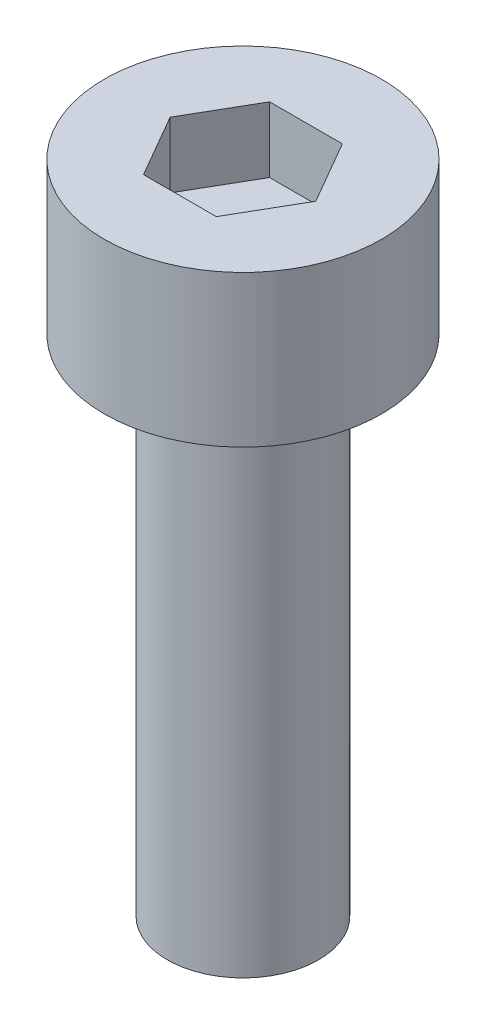
ISO-10303-21;
HEADER;
FILE_DESCRIPTION(('STEP AP214'),'2;1');
FILE_NAME('part.step','',(''),(''),'','','');
FILE_SCHEMA(('AUTOMOTIVE_DESIGN { 1 0 10303 214 1 1 1 1 }'));
ENDSEC;
DATA;
#1=APPLICATION_CONTEXT('core data for automotive mechanical design processes');
#2=APPLICATION_PROTOCOL_DEFINITION('international standard','automotive_design',2000,#1);
#3=PRODUCT_CONTEXT('',#1,'mechanical');
#4=PRODUCT('Part','Part','',(#3));
#5=PRODUCT_RELATED_PRODUCT_CATEGORY('part','',(#4));
#6=PRODUCT_DEFINITION_FORMATION('','',#4);
#7=PRODUCT_DEFINITION_CONTEXT('part definition',#1,'design');
#8=PRODUCT_DEFINITION('design','',#6,#7);
#9=PRODUCT_DEFINITION_SHAPE('','',#8);
#10=(LENGTH_UNIT() NAMED_UNIT(*) SI_UNIT(.MILLI.,.METRE.));
#11=(NAMED_UNIT(*) PLANE_ANGLE_UNIT() SI_UNIT($,.RADIAN.));
#12=(NAMED_UNIT(*) SI_UNIT($,.STERADIAN.) SOLID_ANGLE_UNIT());
#13=UNCERTAINTY_MEASURE_WITH_UNIT(LENGTH_MEASURE(1.E-05),#10,'distance_accuracy_value','');
#14=(GEOMETRIC_REPRESENTATION_CONTEXT(3) GLOBAL_UNCERTAINTY_ASSIGNED_CONTEXT((#13)) GLOBAL_UNIT_ASSIGNED_CONTEXT((#10,
#11,#12)) REPRESENTATION_CONTEXT('',''));
#15=CARTESIAN_POINT('',(0.,0.,0.));
#16=DIRECTION('',(0.,0.,1.));
#17=DIRECTION('',(1.,0.,0.));
#18=AXIS2_PLACEMENT_3D('',#15,#16,#17);
#19=CARTESIAN_POINT('',(0.,3.,0.));
#20=DIRECTION('',(0.,-1.,0.));
#21=DIRECTION('',(0.,0.,-1.));
#22=AXIS2_PLACEMENT_3D('',#19,#20,#21);
#23=CYLINDRICAL_SURFACE('',#22,2.75);
#24=CARTESIAN_POINT('',(0.,3.,0.));
#25=DIRECTION('',(0.,1.,0.));
#26=DIRECTION('',(0.,0.,1.));
#27=AXIS2_PLACEMENT_3D('',#24,#25,#26);
#28=CIRCLE('',#27,2.75);
#29=CARTESIAN_POINT('',(0.,3.,2.75));
#30=VERTEX_POINT('',#29);
#31=EDGE_CURVE('E45',#30,#30,#28,.T.);
#32=ORIENTED_EDGE('',*,*,#31,.F.);
#33=EDGE_LOOP('',(#32));
#34=FACE_BOUND('',#33,.T.);
#35=CARTESIAN_POINT('',(0.,0.,0.));
#36=DIRECTION('',(0.,1.,0.));
#37=DIRECTION('',(0.,0.,1.));
#38=AXIS2_PLACEMENT_3D('',#35,#36,#37);
#39=CIRCLE('',#38,2.75);
#40=CARTESIAN_POINT('',(0.,0.,2.75));
#41=VERTEX_POINT('',#40);
#42=EDGE_CURVE('E40',#41,#41,#39,.T.);
#43=ORIENTED_EDGE('',*,*,#42,.T.);
#44=EDGE_LOOP('',(#43));
#45=FACE_BOUND('',#44,.T.);
#46=ADVANCED_FACE('F37',(#34,#45),#23,.T.);
#47=CARTESIAN_POINT('',(0.,3.,0.));
#48=DIRECTION('',(0.,1.,0.));
#49=DIRECTION('',(0.,0.,1.));
#50=AXIS2_PLACEMENT_3D('',#47,#48,#49);
#51=PLANE('',#50);
#52=DIRECTION('',(0.5,0.,-0.866025403784439));
#53=VECTOR('',#52,1.);
#54=CARTESIAN_POINT('',(0.721687836487032,3.,1.25));
#55=LINE('',#54,#53);
#56=CARTESIAN_POINT('',(0.721687836487032,3.,1.25));
#57=VERTEX_POINT('',#56);
#58=CARTESIAN_POINT('',(1.44337567297406,3.,0.));
#59=VERTEX_POINT('',#58);
#60=EDGE_CURVE('E53',#57,#59,#55,.T.);
#61=ORIENTED_EDGE('',*,*,#60,.F.);
#62=DIRECTION('',(1.,0.,0.));
#63=VECTOR('',#62,1.);
#64=CARTESIAN_POINT('',(-0.721687836487033,3.,1.25));
#65=LINE('',#64,#63);
#66=CARTESIAN_POINT('',(-0.721687836487033,3.,1.25));
#67=VERTEX_POINT('',#66);
#68=EDGE_CURVE('E137',#67,#57,#65,.T.);
#69=ORIENTED_EDGE('',*,*,#68,.F.);
#70=DIRECTION('',(0.5,0.,0.866025403784439));
#71=VECTOR('',#70,1.);
#72=CARTESIAN_POINT('',(-1.44337567297407,3.,0.));
#73=LINE('',#72,#71);
#74=CARTESIAN_POINT('',(-1.44337567297407,3.,0.));
#75=VERTEX_POINT('',#74);
#76=EDGE_CURVE('E135',#75,#67,#73,.T.);
#77=ORIENTED_EDGE('',*,*,#76,.F.);
#78=DIRECTION('',(-0.5,0.,0.866025403784438));
#79=VECTOR('',#78,1.);
#80=CARTESIAN_POINT('',(-0.721687836487033,3.,-1.25));
#81=LINE('',#80,#79);
#82=CARTESIAN_POINT('',(-0.721687836487033,3.,-1.25));
#83=VERTEX_POINT('',#82);
#84=EDGE_CURVE('E101',#83,#75,#81,.T.);
#85=ORIENTED_EDGE('',*,*,#84,.F.);
#86=DIRECTION('',(-1.,0.,0.));
#87=VECTOR('',#86,1.);
#88=CARTESIAN_POINT('',(0.721687836487032,3.,-1.25));
#89=LINE('',#88,#87);
#90=CARTESIAN_POINT('',(0.721687836487032,3.,-1.25));
#91=VERTEX_POINT('',#90);
#92=EDGE_CURVE('E131',#91,#83,#89,.T.);
#93=ORIENTED_EDGE('',*,*,#92,.F.);
#94=DIRECTION('',(-0.5,0.,-0.866025403784439));
#95=VECTOR('',#94,1.);
#96=CARTESIAN_POINT('',(1.44337567297406,3.,0.));
#97=LINE('',#96,#95);
#98=EDGE_CURVE('E127',#59,#91,#97,.T.);
#99=ORIENTED_EDGE('',*,*,#98,.F.);
#100=EDGE_LOOP('',(#61,#69,#77,#85,#93,#99));
#101=FACE_BOUND('',#100,.T.);
#102=ORIENTED_EDGE('',*,*,#31,.T.);
#103=EDGE_LOOP('',(#102));
#104=FACE_BOUND('',#103,.T.);
#105=ADVANCED_FACE('F155',(#101,#104),#51,.T.);
#106=CARTESIAN_POINT('',(0.,0.,0.));
#107=DIRECTION('',(0.,1.,0.));
#108=DIRECTION('',(0.,0.,1.));
#109=AXIS2_PLACEMENT_3D('',#106,#107,#108);
#110=PLANE('',#109);
#111=CARTESIAN_POINT('',(0.,0.,0.));
#112=DIRECTION('',(0.,-1.,0.));
#113=DIRECTION('',(0.,0.,-1.));
#114=AXIS2_PLACEMENT_3D('',#111,#112,#113);
#115=CIRCLE('',#114,1.5);
#116=CARTESIAN_POINT('',(0.,0.,-1.5));
#117=VERTEX_POINT('',#116);
#118=EDGE_CURVE('E11',#117,#117,#115,.T.);
#119=ORIENTED_EDGE('',*,*,#118,.F.);
#120=EDGE_LOOP('',(#119));
#121=FACE_BOUND('',#120,.T.);
#122=ORIENTED_EDGE('',*,*,#42,.F.);
#123=EDGE_LOOP('',(#122));
#124=FACE_BOUND('',#123,.T.);
#125=ADVANCED_FACE('F152',(#121,#124),#110,.F.);
#126=CARTESIAN_POINT('',(0.721687836487032,1.7,1.25));
#127=DIRECTION('',(0.866025403784439,0.,0.5));
#128=DIRECTION('',(0.5,0.,-0.866025403784439));
#129=AXIS2_PLACEMENT_3D('',#126,#127,#128);
#130=PLANE('',#129);
#131=ORIENTED_EDGE('',*,*,#60,.T.);
#132=DIRECTION('',(0.,1.,0.));
#133=VECTOR('',#132,1.);
#134=CARTESIAN_POINT('',(1.44337567297406,1.7,0.));
#135=LINE('',#134,#133);
#136=CARTESIAN_POINT('',(1.44337567297406,1.7,0.));
#137=VERTEX_POINT('',#136);
#138=EDGE_CURVE('E83',#137,#59,#135,.T.);
#139=ORIENTED_EDGE('',*,*,#138,.F.);
#140=DIRECTION('',(0.5,0.,-0.866025403784439));
#141=VECTOR('',#140,1.);
#142=CARTESIAN_POINT('',(0.721687836487032,1.7,1.25));
#143=LINE('',#142,#141);
#144=CARTESIAN_POINT('',(0.721687836487032,1.7,1.25));
#145=VERTEX_POINT('',#144);
#146=EDGE_CURVE('E139',#145,#137,#143,.T.);
#147=ORIENTED_EDGE('',*,*,#146,.F.);
#148=DIRECTION('',(0.,1.,0.));
#149=VECTOR('',#148,1.);
#150=CARTESIAN_POINT('',(0.721687836487032,1.7,1.25));
#151=LINE('',#150,#149);
#152=EDGE_CURVE('E61',#145,#57,#151,.T.);
#153=ORIENTED_EDGE('',*,*,#152,.T.);
#154=EDGE_LOOP('',(#131,#139,#147,#153));
#155=FACE_BOUND('',#154,.T.);
#156=ADVANCED_FACE('F154',(#155),#130,.F.);
#157=CARTESIAN_POINT('',(-0.721687836487033,1.7,1.25));
#158=DIRECTION('',(0.,0.,1.));
#159=DIRECTION('',(1.,0.,0.));
#160=AXIS2_PLACEMENT_3D('',#157,#158,#159);
#161=PLANE('',#160);
#162=ORIENTED_EDGE('',*,*,#68,.T.);
#163=ORIENTED_EDGE('',*,*,#152,.F.);
#164=DIRECTION('',(1.,0.,0.));
#165=VECTOR('',#164,1.);
#166=CARTESIAN_POINT('',(-0.721687836487033,1.7,1.25));
#167=LINE('',#166,#165);
#168=CARTESIAN_POINT('',(-0.721687836487033,1.7,1.25));
#169=VERTEX_POINT('',#168);
#170=EDGE_CURVE('E113',#169,#145,#167,.T.);
#171=ORIENTED_EDGE('',*,*,#170,.F.);
#172=DIRECTION('',(0.,1.,0.));
#173=VECTOR('',#172,1.);
#174=CARTESIAN_POINT('',(-0.721687836487033,1.7,1.25));
#175=LINE('',#174,#173);
#176=EDGE_CURVE('E105',#169,#67,#175,.T.);
#177=ORIENTED_EDGE('',*,*,#176,.T.);
#178=EDGE_LOOP('',(#162,#163,#171,#177));
#179=FACE_BOUND('',#178,.T.);
#180=ADVANCED_FACE('F161',(#179),#161,.F.);
#181=CARTESIAN_POINT('',(-1.44337567297407,1.7,0.));
#182=DIRECTION('',(-0.866025403784439,0.,0.5));
#183=DIRECTION('',(0.5,0.,0.866025403784439));
#184=AXIS2_PLACEMENT_3D('',#181,#182,#183);
#185=PLANE('',#184);
#186=ORIENTED_EDGE('',*,*,#76,.T.);
#187=ORIENTED_EDGE('',*,*,#176,.F.);
#188=DIRECTION('',(0.5,0.,0.866025403784439));
#189=VECTOR('',#188,1.);
#190=CARTESIAN_POINT('',(-1.44337567297407,1.7,0.));
#191=LINE('',#190,#189);
#192=CARTESIAN_POINT('',(-1.44337567297407,1.7,0.));
#193=VERTEX_POINT('',#192);
#194=EDGE_CURVE('E109',#193,#169,#191,.T.);
#195=ORIENTED_EDGE('',*,*,#194,.F.);
#196=DIRECTION('',(0.,1.,0.));
#197=VECTOR('',#196,1.);
#198=CARTESIAN_POINT('',(-1.44337567297407,1.7,0.));
#199=LINE('',#198,#197);
#200=EDGE_CURVE('E94',#193,#75,#199,.T.);
#201=ORIENTED_EDGE('',*,*,#200,.T.);
#202=EDGE_LOOP('',(#186,#187,#195,#201));
#203=FACE_BOUND('',#202,.T.);
#204=ADVANCED_FACE('F110',(#203),#185,.F.);
#205=CARTESIAN_POINT('',(-0.721687836487033,1.7,-1.25));
#206=DIRECTION('',(-0.866025403784439,0.,-0.5));
#207=DIRECTION('',(-0.5,0.,0.866025403784439));
#208=AXIS2_PLACEMENT_3D('',#205,#206,#207);
#209=PLANE('',#208);
#210=ORIENTED_EDGE('',*,*,#84,.T.);
#211=ORIENTED_EDGE('',*,*,#200,.F.);
#212=DIRECTION('',(-0.5,0.,0.866025403784438));
#213=VECTOR('',#212,1.);
#214=CARTESIAN_POINT('',(-0.721687836487033,1.7,-1.25));
#215=LINE('',#214,#213);
#216=CARTESIAN_POINT('',(-0.721687836487033,1.7,-1.25));
#217=VERTEX_POINT('',#216);
#218=EDGE_CURVE('E98',#217,#193,#215,.T.);
#219=ORIENTED_EDGE('',*,*,#218,.F.);
#220=DIRECTION('',(0.,1.,0.));
#221=VECTOR('',#220,1.);
#222=CARTESIAN_POINT('',(-0.721687836487033,1.7,-1.25));
#223=LINE('',#222,#221);
#224=EDGE_CURVE('E106',#217,#83,#223,.T.);
#225=ORIENTED_EDGE('',*,*,#224,.T.);
#226=EDGE_LOOP('',(#210,#211,#219,#225));
#227=FACE_BOUND('',#226,.T.);
#228=ADVANCED_FACE('F96',(#227),#209,.F.);
#229=CARTESIAN_POINT('',(0.721687836487032,1.7,-1.25));
#230=DIRECTION('',(0.,0.,-1.));
#231=DIRECTION('',(-1.,0.,0.));
#232=AXIS2_PLACEMENT_3D('',#229,#230,#231);
#233=PLANE('',#232);
#234=ORIENTED_EDGE('',*,*,#92,.T.);
#235=ORIENTED_EDGE('',*,*,#224,.F.);
#236=DIRECTION('',(-1.,0.,0.));
#237=VECTOR('',#236,1.);
#238=CARTESIAN_POINT('',(0.721687836487032,1.7,-1.25));
#239=LINE('',#238,#237);
#240=CARTESIAN_POINT('',(0.721687836487032,1.7,-1.25));
#241=VERTEX_POINT('',#240);
#242=EDGE_CURVE('E119',#241,#217,#239,.T.);
#243=ORIENTED_EDGE('',*,*,#242,.F.);
#244=DIRECTION('',(0.,1.,0.));
#245=VECTOR('',#244,1.);
#246=CARTESIAN_POINT('',(0.721687836487032,1.7,-1.25));
#247=LINE('',#246,#245);
#248=EDGE_CURVE('E143',#241,#91,#247,.T.);
#249=ORIENTED_EDGE('',*,*,#248,.T.);
#250=EDGE_LOOP('',(#234,#235,#243,#249));
#251=FACE_BOUND('',#250,.T.);
#252=ADVANCED_FACE('F206',(#251),#233,.F.);
#253=CARTESIAN_POINT('',(1.44337567297406,1.7,0.));
#254=DIRECTION('',(0.866025403784439,0.,-0.5));
#255=DIRECTION('',(-0.5,0.,-0.866025403784439));
#256=AXIS2_PLACEMENT_3D('',#253,#254,#255);
#257=PLANE('',#256);
#258=ORIENTED_EDGE('',*,*,#98,.T.);
#259=ORIENTED_EDGE('',*,*,#248,.F.);
#260=DIRECTION('',(-0.5,0.,-0.866025403784439));
#261=VECTOR('',#260,1.);
#262=CARTESIAN_POINT('',(1.44337567297406,1.7,0.));
#263=LINE('',#262,#261);
#264=EDGE_CURVE('E121',#137,#241,#263,.T.);
#265=ORIENTED_EDGE('',*,*,#264,.F.);
#266=ORIENTED_EDGE('',*,*,#138,.T.);
#267=EDGE_LOOP('',(#258,#259,#265,#266));
#268=FACE_BOUND('',#267,.T.);
#269=ADVANCED_FACE('F215',(#268),#257,.F.);
#270=CARTESIAN_POINT('',(0.,1.7,0.));
#271=DIRECTION('',(0.,1.,0.));
#272=DIRECTION('',(0.,0.,1.));
#273=AXIS2_PLACEMENT_3D('',#270,#271,#272);
#274=PLANE('',#273);
#275=ORIENTED_EDGE('',*,*,#146,.T.);
#276=ORIENTED_EDGE('',*,*,#264,.T.);
#277=ORIENTED_EDGE('',*,*,#242,.T.);
#278=ORIENTED_EDGE('',*,*,#218,.T.);
#279=ORIENTED_EDGE('',*,*,#194,.T.);
#280=ORIENTED_EDGE('',*,*,#170,.T.);
#281=EDGE_LOOP('',(#275,#276,#277,#278,#279,#280));
#282=FACE_BOUND('',#281,.T.);
#283=ADVANCED_FACE('F116',(#282),#274,.T.);
#284=CARTESIAN_POINT('',(0.,-10.,0.));
#285=DIRECTION('',(0.,1.,0.));
#286=DIRECTION('',(0.,0.,1.));
#287=AXIS2_PLACEMENT_3D('',#284,#285,#286);
#288=CYLINDRICAL_SURFACE('',#287,1.5);
#289=CARTESIAN_POINT('',(0.,-10.,0.));
#290=DIRECTION('',(0.,-1.,0.));
#291=DIRECTION('',(0.,0.,-1.));
#292=AXIS2_PLACEMENT_3D('',#289,#290,#291);
#293=CIRCLE('',#292,1.5);
#294=CARTESIAN_POINT('',(0.,-10.,-1.5));
#295=VERTEX_POINT('',#294);
#296=EDGE_CURVE('E128',#295,#295,#293,.T.);
#297=ORIENTED_EDGE('',*,*,#296,.F.);
#298=EDGE_LOOP('',(#297));
#299=FACE_BOUND('',#298,.T.);
#300=ORIENTED_EDGE('',*,*,#118,.T.);
#301=EDGE_LOOP('',(#300));
#302=FACE_BOUND('',#301,.T.);
#303=ADVANCED_FACE('F233',(#299,#302),#288,.T.);
#304=CARTESIAN_POINT('',(0.,-10.,0.));
#305=DIRECTION('',(0.,-1.,0.));
#306=DIRECTION('',(0.,0.,-1.));
#307=AXIS2_PLACEMENT_3D('',#304,#305,#306);
#308=PLANE('',#307);
#309=ORIENTED_EDGE('',*,*,#296,.T.);
#310=EDGE_LOOP('',(#309));
#311=FACE_BOUND('',#310,.T.);
#312=ADVANCED_FACE('F247',(#311),#308,.T.);
#313=CLOSED_SHELL('',(#46,#105,#125,#156,#180,#204,#228,#252,#269,#283,#303,#312));
#314=MANIFOLD_SOLID_BREP('B2',#313);
#315=ADVANCED_BREP_SHAPE_REPRESENTATION('',(#18,#314),#14);
#316=SHAPE_DEFINITION_REPRESENTATION(#9,#315);
ENDSEC;
END-ISO-10303-21;
